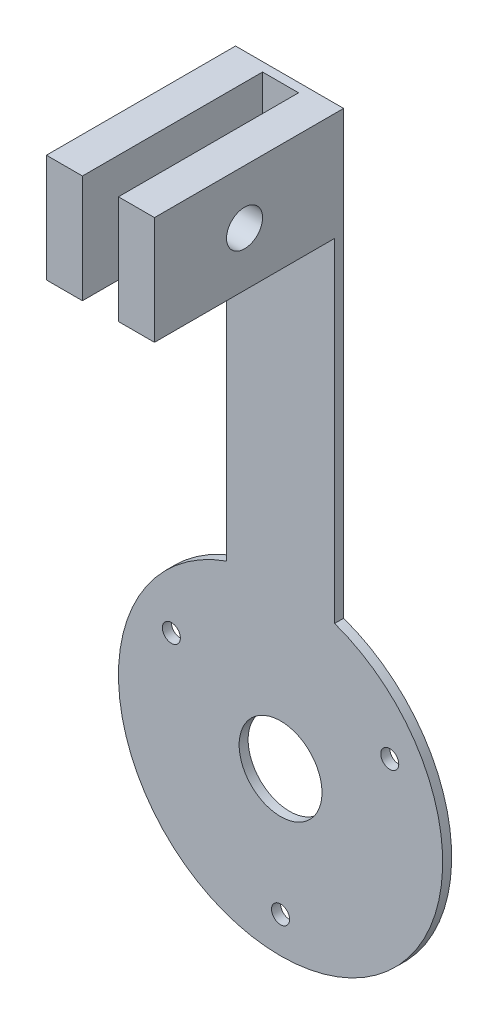
ISO-10303-21;
HEADER;
FILE_DESCRIPTION(('STEP AP214'),'2;1');
FILE_NAME('part.step','',(''),(''),'','','');
FILE_SCHEMA(('AUTOMOTIVE_DESIGN { 1 0 10303 214 1 1 1 1 }'));
ENDSEC;
DATA;
#1=APPLICATION_CONTEXT('core data for automotive mechanical design processes');
#2=APPLICATION_PROTOCOL_DEFINITION('international standard','automotive_design',2000,#1);
#3=PRODUCT_CONTEXT('',#1,'mechanical');
#4=PRODUCT('Part','Part','',(#3));
#5=PRODUCT_RELATED_PRODUCT_CATEGORY('part','',(#4));
#6=PRODUCT_DEFINITION_FORMATION('','',#4);
#7=PRODUCT_DEFINITION_CONTEXT('part definition',#1,'design');
#8=PRODUCT_DEFINITION('design','',#6,#7);
#9=PRODUCT_DEFINITION_SHAPE('','',#8);
#10=(LENGTH_UNIT() NAMED_UNIT(*) SI_UNIT(.MILLI.,.METRE.));
#11=(NAMED_UNIT(*) PLANE_ANGLE_UNIT() SI_UNIT($,.RADIAN.));
#12=(NAMED_UNIT(*) SI_UNIT($,.STERADIAN.) SOLID_ANGLE_UNIT());
#13=UNCERTAINTY_MEASURE_WITH_UNIT(LENGTH_MEASURE(1.E-05),#10,'distance_accuracy_value','');
#14=(GEOMETRIC_REPRESENTATION_CONTEXT(3) GLOBAL_UNCERTAINTY_ASSIGNED_CONTEXT((#13)) GLOBAL_UNIT_ASSIGNED_CONTEXT((#10,
#11,#12)) REPRESENTATION_CONTEXT('',''));
#15=CARTESIAN_POINT('',(0.,0.,0.));
#16=DIRECTION('',(0.,0.,1.));
#17=DIRECTION('',(1.,0.,0.));
#18=AXIS2_PLACEMENT_3D('',#15,#16,#17);
#19=CARTESIAN_POINT('',(0.,0.,3.175));
#20=DIRECTION('',(0.,0.,1.));
#21=DIRECTION('',(1.,0.,0.));
#22=AXIS2_PLACEMENT_3D('',#19,#20,#21);
#23=PLANE('',#22);
#24=CARTESIAN_POINT('',(0.,0.,3.175));
#25=DIRECTION('',(0.,0.,1.));
#26=DIRECTION('',(1.,0.,0.));
#27=AXIS2_PLACEMENT_3D('',#24,#25,#26);
#28=CIRCLE('',#27,57.15);
#29=CARTESIAN_POINT('',(-19.05,53.8815367264149,3.175));
#30=VERTEX_POINT('',#29);
#31=CARTESIAN_POINT('',(19.05,53.8815367264149,3.175));
#32=VERTEX_POINT('',#31);
#33=EDGE_CURVE('E139',#30,#32,#28,.T.);
#34=ORIENTED_EDGE('',*,*,#33,.T.);
#35=DIRECTION('',(0.,1.,0.));
#36=VECTOR('',#35,1.);
#37=CARTESIAN_POINT('',(19.05,0.,3.175));
#38=LINE('',#37,#36);
#39=CARTESIAN_POINT('',(19.05,171.45,3.175));
#40=VERTEX_POINT('',#39);
#41=EDGE_CURVE('E252',#32,#40,#38,.T.);
#42=ORIENTED_EDGE('',*,*,#41,.T.);
#43=DIRECTION('',(1.,0.,0.));
#44=VECTOR('',#43,1.);
#45=CARTESIAN_POINT('',(0.,171.45,3.175));
#46=LINE('',#45,#44);
#47=CARTESIAN_POINT('',(6.34999999999998,171.45,3.175));
#48=VERTEX_POINT('',#47);
#49=EDGE_CURVE('E171',#48,#40,#46,.T.);
#50=ORIENTED_EDGE('',*,*,#49,.F.);
#51=DIRECTION('',(0.,-1.,0.));
#52=VECTOR('',#51,1.);
#53=CARTESIAN_POINT('',(6.34999999999995,0.,3.175));
#54=LINE('',#53,#52);
#55=CARTESIAN_POINT('',(6.34999999999999,209.55,3.175));
#56=VERTEX_POINT('',#55);
#57=EDGE_CURVE('E165',#56,#48,#54,.T.);
#58=ORIENTED_EDGE('',*,*,#57,.F.);
#59=DIRECTION('',(1.,0.,0.));
#60=VECTOR('',#59,1.);
#61=CARTESIAN_POINT('',(0.,209.55,3.175));
#62=LINE('',#61,#60);
#63=CARTESIAN_POINT('',(-6.34999999999999,209.55,3.175));
#64=VERTEX_POINT('',#63);
#65=EDGE_CURVE('E58',#64,#56,#62,.T.);
#66=ORIENTED_EDGE('',*,*,#65,.F.);
#67=DIRECTION('',(0.,-1.,0.));
#68=VECTOR('',#67,1.);
#69=CARTESIAN_POINT('',(-6.34999999999995,0.,3.175));
#70=LINE('',#69,#68);
#71=CARTESIAN_POINT('',(-6.34999999999998,171.45,3.175));
#72=VERTEX_POINT('',#71);
#73=EDGE_CURVE('E196',#64,#72,#70,.T.);
#74=ORIENTED_EDGE('',*,*,#73,.T.);
#75=DIRECTION('',(1.,0.,0.));
#76=VECTOR('',#75,1.);
#77=CARTESIAN_POINT('',(0.,171.45,3.175));
#78=LINE('',#77,#76);
#79=CARTESIAN_POINT('',(-19.05,171.45,3.175));
#80=VERTEX_POINT('',#79);
#81=EDGE_CURVE('E64',#80,#72,#78,.T.);
#82=ORIENTED_EDGE('',*,*,#81,.F.);
#83=DIRECTION('',(0.,1.,0.));
#84=VECTOR('',#83,1.);
#85=CARTESIAN_POINT('',(-19.05,0.,3.175));
#86=LINE('',#85,#84);
#87=EDGE_CURVE('E249',#30,#80,#86,.T.);
#88=ORIENTED_EDGE('',*,*,#87,.F.);
#89=EDGE_LOOP('',(#34,#42,#50,#58,#66,#74,#82,#88));
#90=FACE_BOUND('',#89,.T.);
#91=CARTESIAN_POINT('',(-38.4948291982183,22.225,3.175));
#92=DIRECTION('',(0.,0.,1.));
#93=DIRECTION('',(1.,0.,0.));
#94=AXIS2_PLACEMENT_3D('',#91,#92,#93);
#95=CIRCLE('',#94,3.175);
#96=CARTESIAN_POINT('',(-35.3198291982183,22.225,3.175));
#97=VERTEX_POINT('',#96);
#98=EDGE_CURVE('E230',#97,#97,#95,.T.);
#99=ORIENTED_EDGE('',*,*,#98,.F.);
#100=EDGE_LOOP('',(#99));
#101=FACE_BOUND('',#100,.T.);
#102=CARTESIAN_POINT('',(38.4948291982183,22.225,3.175));
#103=DIRECTION('',(0.,0.,1.));
#104=DIRECTION('',(1.,0.,0.));
#105=AXIS2_PLACEMENT_3D('',#102,#103,#104);
#106=CIRCLE('',#105,3.175);
#107=CARTESIAN_POINT('',(41.6698291982183,22.225,3.175));
#108=VERTEX_POINT('',#107);
#109=EDGE_CURVE('E238',#108,#108,#106,.T.);
#110=ORIENTED_EDGE('',*,*,#109,.F.);
#111=EDGE_LOOP('',(#110));
#112=FACE_BOUND('',#111,.T.);
#113=CARTESIAN_POINT('',(0.,-44.45,3.175));
#114=DIRECTION('',(0.,0.,1.));
#115=DIRECTION('',(1.,0.,0.));
#116=AXIS2_PLACEMENT_3D('',#113,#114,#115);
#117=CIRCLE('',#116,3.175);
#118=CARTESIAN_POINT('',(3.175,-44.45,3.175));
#119=VERTEX_POINT('',#118);
#120=EDGE_CURVE('E226',#119,#119,#117,.T.);
#121=ORIENTED_EDGE('',*,*,#120,.F.);
#122=EDGE_LOOP('',(#121));
#123=FACE_BOUND('',#122,.T.);
#124=CARTESIAN_POINT('',(0.,0.,3.175));
#125=DIRECTION('',(0.,0.,1.));
#126=DIRECTION('',(1.,0.,0.));
#127=AXIS2_PLACEMENT_3D('',#124,#125,#126);
#128=CIRCLE('',#127,14.605);
#129=CARTESIAN_POINT('',(14.605,0.,3.175));
#130=VERTEX_POINT('',#129);
#131=EDGE_CURVE('E259',#130,#130,#128,.T.);
#132=ORIENTED_EDGE('',*,*,#131,.F.);
#133=EDGE_LOOP('',(#132));
#134=FACE_BOUND('',#133,.T.);
#135=ADVANCED_FACE('F41',(#90,#101,#112,#123,#134),#23,.T.);
#136=CARTESIAN_POINT('',(-19.05,0.,3.175));
#137=DIRECTION('',(-1.,0.,0.));
#138=DIRECTION('',(0.,0.,1.));
#139=AXIS2_PLACEMENT_3D('',#136,#137,#138);
#140=PLANE('',#139);
#141=CARTESIAN_POINT('',(-19.05,190.5,34.925));
#142=DIRECTION('',(-1.,0.,0.));
#143=DIRECTION('',(0.,0.,1.));
#144=AXIS2_PLACEMENT_3D('',#141,#142,#143);
#145=CIRCLE('',#144,6.35);
#146=CARTESIAN_POINT('',(-19.05,190.5,41.275));
#147=VERTEX_POINT('',#146);
#148=EDGE_CURVE('E152',#147,#147,#145,.T.);
#149=ORIENTED_EDGE('',*,*,#148,.F.);
#150=EDGE_LOOP('',(#149));
#151=FACE_BOUND('',#150,.T.);
#152=DIRECTION('',(0.,1.,0.));
#153=VECTOR('',#152,1.);
#154=CARTESIAN_POINT('',(-19.05,0.,0.));
#155=LINE('',#154,#153);
#156=CARTESIAN_POINT('',(-19.05,53.8815367264149,0.));
#157=VERTEX_POINT('',#156);
#158=CARTESIAN_POINT('',(-19.05,209.55,0.));
#159=VERTEX_POINT('',#158);
#160=EDGE_CURVE('E119',#157,#159,#155,.T.);
#161=ORIENTED_EDGE('',*,*,#160,.F.);
#162=DIRECTION('',(0.,0.,1.));
#163=VECTOR('',#162,1.);
#164=CARTESIAN_POINT('',(-19.05,53.8815367264149,0.));
#165=LINE('',#164,#163);
#166=EDGE_CURVE('E121',#157,#30,#165,.T.);
#167=ORIENTED_EDGE('',*,*,#166,.T.);
#168=ORIENTED_EDGE('',*,*,#87,.T.);
#169=DIRECTION('',(0.,0.,-1.));
#170=VECTOR('',#169,1.);
#171=CARTESIAN_POINT('',(-19.05,171.45,66.675));
#172=LINE('',#171,#170);
#173=CARTESIAN_POINT('',(-19.05,171.45,66.675));
#174=VERTEX_POINT('',#173);
#175=EDGE_CURVE('E219',#174,#80,#172,.T.);
#176=ORIENTED_EDGE('',*,*,#175,.F.);
#177=DIRECTION('',(0.,-1.,0.));
#178=VECTOR('',#177,1.);
#179=CARTESIAN_POINT('',(-19.05,0.,66.675));
#180=LINE('',#179,#178);
#181=CARTESIAN_POINT('',(-19.05,209.55,66.675));
#182=VERTEX_POINT('',#181);
#183=EDGE_CURVE('E205',#182,#174,#180,.T.);
#184=ORIENTED_EDGE('',*,*,#183,.F.);
#185=DIRECTION('',(0.,0.,-1.));
#186=VECTOR('',#185,1.);
#187=CARTESIAN_POINT('',(-19.05,209.55,3.175));
#188=LINE('',#187,#186);
#189=EDGE_CURVE('E51',#182,#159,#188,.T.);
#190=ORIENTED_EDGE('',*,*,#189,.T.);
#191=EDGE_LOOP('',(#161,#167,#168,#176,#184,#190));
#192=FACE_BOUND('',#191,.T.);
#193=ADVANCED_FACE('F43',(#151,#192),#140,.T.);
#194=CARTESIAN_POINT('',(19.05,0.,3.175));
#195=DIRECTION('',(-1.,0.,0.));
#196=DIRECTION('',(0.,0.,1.));
#197=AXIS2_PLACEMENT_3D('',#194,#195,#196);
#198=PLANE('',#197);
#199=CARTESIAN_POINT('',(19.05,190.5,34.925));
#200=DIRECTION('',(-1.,0.,0.));
#201=DIRECTION('',(0.,0.,1.));
#202=AXIS2_PLACEMENT_3D('',#199,#200,#201);
#203=CIRCLE('',#202,6.35);
#204=CARTESIAN_POINT('',(19.05,190.5,41.275));
#205=VERTEX_POINT('',#204);
#206=EDGE_CURVE('E161',#205,#205,#203,.T.);
#207=ORIENTED_EDGE('',*,*,#206,.T.);
#208=EDGE_LOOP('',(#207));
#209=FACE_BOUND('',#208,.T.);
#210=DIRECTION('',(0.,1.,0.));
#211=VECTOR('',#210,1.);
#212=CARTESIAN_POINT('',(19.05,0.,0.));
#213=LINE('',#212,#211);
#214=CARTESIAN_POINT('',(19.05,53.8815367264149,0.));
#215=VERTEX_POINT('',#214);
#216=CARTESIAN_POINT('',(19.05,209.55,0.));
#217=VERTEX_POINT('',#216);
#218=EDGE_CURVE('E129',#215,#217,#213,.T.);
#219=ORIENTED_EDGE('',*,*,#218,.T.);
#220=DIRECTION('',(0.,0.,-1.));
#221=VECTOR('',#220,1.);
#222=CARTESIAN_POINT('',(19.05,209.55,3.175));
#223=LINE('',#222,#221);
#224=CARTESIAN_POINT('',(19.05,209.55,66.675));
#225=VERTEX_POINT('',#224);
#226=EDGE_CURVE('E11',#225,#217,#223,.T.);
#227=ORIENTED_EDGE('',*,*,#226,.F.);
#228=DIRECTION('',(0.,1.,0.));
#229=VECTOR('',#228,1.);
#230=CARTESIAN_POINT('',(19.05,0.,66.675));
#231=LINE('',#230,#229);
#232=CARTESIAN_POINT('',(19.05,171.45,66.675));
#233=VERTEX_POINT('',#232);
#234=EDGE_CURVE('E174',#233,#225,#231,.T.);
#235=ORIENTED_EDGE('',*,*,#234,.F.);
#236=DIRECTION('',(0.,0.,-1.));
#237=VECTOR('',#236,1.);
#238=CARTESIAN_POINT('',(19.05,171.45,66.675));
#239=LINE('',#238,#237);
#240=EDGE_CURVE('E189',#233,#40,#239,.T.);
#241=ORIENTED_EDGE('',*,*,#240,.T.);
#242=ORIENTED_EDGE('',*,*,#41,.F.);
#243=DIRECTION('',(0.,0.,1.));
#244=VECTOR('',#243,1.);
#245=CARTESIAN_POINT('',(19.05,53.8815367264149,0.));
#246=LINE('',#245,#244);
#247=EDGE_CURVE('E141',#215,#32,#246,.T.);
#248=ORIENTED_EDGE('',*,*,#247,.F.);
#249=EDGE_LOOP('',(#219,#227,#235,#241,#242,#248));
#250=FACE_BOUND('',#249,.T.);
#251=ADVANCED_FACE('F287',(#209,#250),#198,.F.);
#252=CARTESIAN_POINT('',(0.,209.55,3.175));
#253=DIRECTION('',(0.,1.,0.));
#254=DIRECTION('',(0.,0.,1.));
#255=AXIS2_PLACEMENT_3D('',#252,#253,#254);
#256=PLANE('',#255);
#257=DIRECTION('',(1.,0.,0.));
#258=VECTOR('',#257,1.);
#259=CARTESIAN_POINT('',(0.,209.55,0.));
#260=LINE('',#259,#258);
#261=EDGE_CURVE('E265',#159,#217,#260,.T.);
#262=ORIENTED_EDGE('',*,*,#261,.F.);
#263=ORIENTED_EDGE('',*,*,#189,.F.);
#264=DIRECTION('',(-1.,0.,0.));
#265=VECTOR('',#264,1.);
#266=CARTESIAN_POINT('',(0.,209.55,66.675));
#267=LINE('',#266,#265);
#268=CARTESIAN_POINT('',(-6.34999999999999,209.55,66.675));
#269=VERTEX_POINT('',#268);
#270=EDGE_CURVE('E201',#269,#182,#267,.T.);
#271=ORIENTED_EDGE('',*,*,#270,.F.);
#272=DIRECTION('',(0.,0.,-1.));
#273=VECTOR('',#272,1.);
#274=CARTESIAN_POINT('',(-6.34999999999999,209.55,66.675));
#275=LINE('',#274,#273);
#276=EDGE_CURVE('E223',#269,#64,#275,.T.);
#277=ORIENTED_EDGE('',*,*,#276,.T.);
#278=ORIENTED_EDGE('',*,*,#65,.T.);
#279=DIRECTION('',(0.,0.,-1.));
#280=VECTOR('',#279,1.);
#281=CARTESIAN_POINT('',(6.34999999999999,209.55,66.675));
#282=LINE('',#281,#280);
#283=CARTESIAN_POINT('',(6.34999999999999,209.55,66.675));
#284=VERTEX_POINT('',#283);
#285=EDGE_CURVE('E181',#284,#56,#282,.T.);
#286=ORIENTED_EDGE('',*,*,#285,.F.);
#287=DIRECTION('',(-1.,0.,0.));
#288=VECTOR('',#287,1.);
#289=CARTESIAN_POINT('',(0.,209.55,66.675));
#290=LINE('',#289,#288);
#291=EDGE_CURVE('E178',#225,#284,#290,.T.);
#292=ORIENTED_EDGE('',*,*,#291,.F.);
#293=ORIENTED_EDGE('',*,*,#226,.T.);
#294=EDGE_LOOP('',(#262,#263,#271,#277,#278,#286,#292,#293));
#295=FACE_BOUND('',#294,.T.);
#296=ADVANCED_FACE('F290',(#295),#256,.T.);
#297=CARTESIAN_POINT('',(0.,0.,3.175));
#298=DIRECTION('',(0.,0.,-1.));
#299=DIRECTION('',(-1.,0.,0.));
#300=AXIS2_PLACEMENT_3D('',#297,#298,#299);
#301=CYLINDRICAL_SURFACE('',#300,14.605);
#302=ORIENTED_EDGE('',*,*,#131,.T.);
#303=EDGE_LOOP('',(#302));
#304=FACE_BOUND('',#303,.T.);
#305=CARTESIAN_POINT('',(0.,0.,0.));
#306=DIRECTION('',(0.,0.,1.));
#307=DIRECTION('',(1.,0.,0.));
#308=AXIS2_PLACEMENT_3D('',#305,#306,#307);
#309=CIRCLE('',#308,14.605);
#310=CARTESIAN_POINT('',(14.605,0.,0.));
#311=VERTEX_POINT('',#310);
#312=EDGE_CURVE('E253',#311,#311,#309,.T.);
#313=ORIENTED_EDGE('',*,*,#312,.F.);
#314=EDGE_LOOP('',(#313));
#315=FACE_BOUND('',#314,.T.);
#316=ADVANCED_FACE('F339',(#304,#315),#301,.F.);
#317=CARTESIAN_POINT('',(0.,0.,0.));
#318=DIRECTION('',(0.,0.,1.));
#319=DIRECTION('',(1.,0.,0.));
#320=AXIS2_PLACEMENT_3D('',#317,#318,#319);
#321=PLANE('',#320);
#322=CARTESIAN_POINT('',(-38.4948291982183,22.225,0.));
#323=DIRECTION('',(0.,0.,1.));
#324=DIRECTION('',(1.,0.,0.));
#325=AXIS2_PLACEMENT_3D('',#322,#323,#324);
#326=CIRCLE('',#325,3.175);
#327=CARTESIAN_POINT('',(-35.3198291982183,22.225,0.));
#328=VERTEX_POINT('',#327);
#329=EDGE_CURVE('E130',#328,#328,#326,.T.);
#330=ORIENTED_EDGE('',*,*,#329,.T.);
#331=EDGE_LOOP('',(#330));
#332=FACE_BOUND('',#331,.T.);
#333=CARTESIAN_POINT('',(38.4948291982183,22.225,0.));
#334=DIRECTION('',(0.,0.,1.));
#335=DIRECTION('',(1.,0.,0.));
#336=AXIS2_PLACEMENT_3D('',#333,#334,#335);
#337=CIRCLE('',#336,3.175);
#338=CARTESIAN_POINT('',(41.6698291982183,22.225,0.));
#339=VERTEX_POINT('',#338);
#340=EDGE_CURVE('E234',#339,#339,#337,.T.);
#341=ORIENTED_EDGE('',*,*,#340,.T.);
#342=EDGE_LOOP('',(#341));
#343=FACE_BOUND('',#342,.T.);
#344=CARTESIAN_POINT('',(0.,-44.45,0.));
#345=DIRECTION('',(0.,0.,1.));
#346=DIRECTION('',(1.,0.,0.));
#347=AXIS2_PLACEMENT_3D('',#344,#345,#346);
#348=CIRCLE('',#347,3.175);
#349=CARTESIAN_POINT('',(3.175,-44.45,0.));
#350=VERTEX_POINT('',#349);
#351=EDGE_CURVE('E242',#350,#350,#348,.T.);
#352=ORIENTED_EDGE('',*,*,#351,.T.);
#353=EDGE_LOOP('',(#352));
#354=FACE_BOUND('',#353,.T.);
#355=ORIENTED_EDGE('',*,*,#218,.F.);
#356=CARTESIAN_POINT('',(0.,0.,0.));
#357=DIRECTION('',(0.,0.,1.));
#358=DIRECTION('',(1.,0.,0.));
#359=AXIS2_PLACEMENT_3D('',#356,#357,#358);
#360=CIRCLE('',#359,57.15);
#361=EDGE_CURVE('E136',#157,#215,#360,.T.);
#362=ORIENTED_EDGE('',*,*,#361,.F.);
#363=ORIENTED_EDGE('',*,*,#160,.T.);
#364=ORIENTED_EDGE('',*,*,#261,.T.);
#365=EDGE_LOOP('',(#355,#362,#363,#364));
#366=FACE_BOUND('',#365,.T.);
#367=ORIENTED_EDGE('',*,*,#312,.T.);
#368=EDGE_LOOP('',(#367));
#369=FACE_BOUND('',#368,.T.);
#370=ADVANCED_FACE('F143',(#332,#343,#354,#366,#369),#321,.F.);
#371=CARTESIAN_POINT('',(0.,-44.45,0.));
#372=DIRECTION('',(0.,0.,1.));
#373=DIRECTION('',(1.,0.,0.));
#374=AXIS2_PLACEMENT_3D('',#371,#372,#373);
#375=CYLINDRICAL_SURFACE('',#374,3.175);
#376=ORIENTED_EDGE('',*,*,#351,.F.);
#377=EDGE_LOOP('',(#376));
#378=FACE_BOUND('',#377,.T.);
#379=ORIENTED_EDGE('',*,*,#120,.T.);
#380=EDGE_LOOP('',(#379));
#381=FACE_BOUND('',#380,.T.);
#382=ADVANCED_FACE('F335',(#378,#381),#375,.F.);
#383=CARTESIAN_POINT('',(38.4948291982183,22.225,0.));
#384=DIRECTION('',(0.,0.,1.));
#385=DIRECTION('',(1.,0.,0.));
#386=AXIS2_PLACEMENT_3D('',#383,#384,#385);
#387=CYLINDRICAL_SURFACE('',#386,3.175);
#388=ORIENTED_EDGE('',*,*,#340,.F.);
#389=EDGE_LOOP('',(#388));
#390=FACE_BOUND('',#389,.T.);
#391=ORIENTED_EDGE('',*,*,#109,.T.);
#392=EDGE_LOOP('',(#391));
#393=FACE_BOUND('',#392,.T.);
#394=ADVANCED_FACE('F323',(#390,#393),#387,.F.);
#395=CARTESIAN_POINT('',(-38.4948291982183,22.225,0.));
#396=DIRECTION('',(0.,0.,1.));
#397=DIRECTION('',(1.,0.,0.));
#398=AXIS2_PLACEMENT_3D('',#395,#396,#397);
#399=CYLINDRICAL_SURFACE('',#398,3.175);
#400=ORIENTED_EDGE('',*,*,#329,.F.);
#401=EDGE_LOOP('',(#400));
#402=FACE_BOUND('',#401,.T.);
#403=ORIENTED_EDGE('',*,*,#98,.T.);
#404=EDGE_LOOP('',(#403));
#405=FACE_BOUND('',#404,.T.);
#406=ADVANCED_FACE('F315',(#402,#405),#399,.F.);
#407=CARTESIAN_POINT('',(-6.34999999999995,0.,66.675));
#408=DIRECTION('',(1.,0.,0.));
#409=DIRECTION('',(0.,1.,0.));
#410=AXIS2_PLACEMENT_3D('',#407,#408,#409);
#411=PLANE('',#410);
#412=CARTESIAN_POINT('',(-6.34999999999998,190.5,34.925));
#413=DIRECTION('',(1.,0.,0.));
#414=DIRECTION('',(0.,1.,0.));
#415=AXIS2_PLACEMENT_3D('',#412,#413,#414);
#416=CIRCLE('',#415,6.35);
#417=CARTESIAN_POINT('',(-6.34999999999998,196.85,34.925));
#418=VERTEX_POINT('',#417);
#419=EDGE_CURVE('E157',#418,#418,#416,.T.);
#420=ORIENTED_EDGE('',*,*,#419,.F.);
#421=EDGE_LOOP('',(#420));
#422=FACE_BOUND('',#421,.T.);
#423=ORIENTED_EDGE('',*,*,#73,.F.);
#424=ORIENTED_EDGE('',*,*,#276,.F.);
#425=DIRECTION('',(0.,-1.,0.));
#426=VECTOR('',#425,1.);
#427=CARTESIAN_POINT('',(-6.34999999999995,0.,66.675));
#428=LINE('',#427,#426);
#429=CARTESIAN_POINT('',(-6.34999999999998,171.45,66.675));
#430=VERTEX_POINT('',#429);
#431=EDGE_CURVE('E197',#269,#430,#428,.T.);
#432=ORIENTED_EDGE('',*,*,#431,.T.);
#433=DIRECTION('',(0.,0.,-1.));
#434=VECTOR('',#433,1.);
#435=CARTESIAN_POINT('',(-6.34999999999998,171.45,66.675));
#436=LINE('',#435,#434);
#437=EDGE_CURVE('E211',#430,#72,#436,.T.);
#438=ORIENTED_EDGE('',*,*,#437,.T.);
#439=EDGE_LOOP('',(#423,#424,#432,#438));
#440=FACE_BOUND('',#439,.T.);
#441=ADVANCED_FACE('F313',(#422,#440),#411,.T.);
#442=CARTESIAN_POINT('',(0.,171.45,66.675));
#443=DIRECTION('',(0.,1.,0.));
#444=DIRECTION('',(0.,0.,1.));
#445=AXIS2_PLACEMENT_3D('',#442,#443,#444);
#446=PLANE('',#445);
#447=ORIENTED_EDGE('',*,*,#81,.T.);
#448=ORIENTED_EDGE('',*,*,#437,.F.);
#449=DIRECTION('',(1.,0.,0.));
#450=VECTOR('',#449,1.);
#451=CARTESIAN_POINT('',(0.,171.45,66.675));
#452=LINE('',#451,#450);
#453=EDGE_CURVE('E208',#174,#430,#452,.T.);
#454=ORIENTED_EDGE('',*,*,#453,.F.);
#455=ORIENTED_EDGE('',*,*,#175,.T.);
#456=EDGE_LOOP('',(#447,#448,#454,#455));
#457=FACE_BOUND('',#456,.T.);
#458=ADVANCED_FACE('F306',(#457),#446,.F.);
#459=CARTESIAN_POINT('',(0.,0.,66.675));
#460=DIRECTION('',(0.,0.,1.));
#461=DIRECTION('',(1.,0.,0.));
#462=AXIS2_PLACEMENT_3D('',#459,#460,#461);
#463=PLANE('',#462);
#464=ORIENTED_EDGE('',*,*,#431,.F.);
#465=ORIENTED_EDGE('',*,*,#270,.T.);
#466=ORIENTED_EDGE('',*,*,#183,.T.);
#467=ORIENTED_EDGE('',*,*,#453,.T.);
#468=EDGE_LOOP('',(#464,#465,#466,#467));
#469=FACE_BOUND('',#468,.T.);
#470=ADVANCED_FACE('F310',(#469),#463,.T.);
#471=CARTESIAN_POINT('',(6.34999999999995,0.,66.675));
#472=DIRECTION('',(1.,0.,0.));
#473=DIRECTION('',(0.,1.,0.));
#474=AXIS2_PLACEMENT_3D('',#471,#472,#473);
#475=PLANE('',#474);
#476=CARTESIAN_POINT('',(6.34999999999998,190.5,34.925));
#477=DIRECTION('',(1.,0.,0.));
#478=DIRECTION('',(0.,1.,0.));
#479=AXIS2_PLACEMENT_3D('',#476,#477,#478);
#480=CIRCLE('',#479,6.35);
#481=CARTESIAN_POINT('',(6.34999999999998,196.85,34.925));
#482=VERTEX_POINT('',#481);
#483=EDGE_CURVE('E45',#482,#482,#480,.T.);
#484=ORIENTED_EDGE('',*,*,#483,.T.);
#485=EDGE_LOOP('',(#484));
#486=FACE_BOUND('',#485,.T.);
#487=ORIENTED_EDGE('',*,*,#57,.T.);
#488=DIRECTION('',(0.,0.,-1.));
#489=VECTOR('',#488,1.);
#490=CARTESIAN_POINT('',(6.34999999999998,171.45,66.675));
#491=LINE('',#490,#489);
#492=CARTESIAN_POINT('',(6.34999999999998,171.45,66.675));
#493=VERTEX_POINT('',#492);
#494=EDGE_CURVE('E193',#493,#48,#491,.T.);
#495=ORIENTED_EDGE('',*,*,#494,.F.);
#496=DIRECTION('',(0.,-1.,0.));
#497=VECTOR('',#496,1.);
#498=CARTESIAN_POINT('',(6.34999999999995,0.,66.675));
#499=LINE('',#498,#497);
#500=EDGE_CURVE('E166',#284,#493,#499,.T.);
#501=ORIENTED_EDGE('',*,*,#500,.F.);
#502=ORIENTED_EDGE('',*,*,#285,.T.);
#503=EDGE_LOOP('',(#487,#495,#501,#502));
#504=FACE_BOUND('',#503,.T.);
#505=ADVANCED_FACE('F276',(#486,#504),#475,.F.);
#506=CARTESIAN_POINT('',(0.,171.45,66.675));
#507=DIRECTION('',(0.,1.,0.));
#508=DIRECTION('',(0.,0.,1.));
#509=AXIS2_PLACEMENT_3D('',#506,#507,#508);
#510=PLANE('',#509);
#511=ORIENTED_EDGE('',*,*,#49,.T.);
#512=ORIENTED_EDGE('',*,*,#240,.F.);
#513=DIRECTION('',(1.,0.,0.));
#514=VECTOR('',#513,1.);
#515=CARTESIAN_POINT('',(0.,171.45,66.675));
#516=LINE('',#515,#514);
#517=EDGE_CURVE('E170',#493,#233,#516,.T.);
#518=ORIENTED_EDGE('',*,*,#517,.F.);
#519=ORIENTED_EDGE('',*,*,#494,.T.);
#520=EDGE_LOOP('',(#511,#512,#518,#519));
#521=FACE_BOUND('',#520,.T.);
#522=ADVANCED_FACE('F453',(#521),#510,.F.);
#523=CARTESIAN_POINT('',(0.,0.,66.675));
#524=DIRECTION('',(0.,0.,1.));
#525=DIRECTION('',(1.,0.,0.));
#526=AXIS2_PLACEMENT_3D('',#523,#524,#525);
#527=PLANE('',#526);
#528=ORIENTED_EDGE('',*,*,#500,.T.);
#529=ORIENTED_EDGE('',*,*,#517,.T.);
#530=ORIENTED_EDGE('',*,*,#234,.T.);
#531=ORIENTED_EDGE('',*,*,#291,.T.);
#532=EDGE_LOOP('',(#528,#529,#530,#531));
#533=FACE_BOUND('',#532,.T.);
#534=ADVANCED_FACE('F283',(#533),#527,.T.);
#535=CARTESIAN_POINT('',(88.9,190.5,34.925));
#536=DIRECTION('',(-1.,0.,0.));
#537=DIRECTION('',(0.,0.,1.));
#538=AXIS2_PLACEMENT_3D('',#535,#536,#537);
#539=CYLINDRICAL_SURFACE('',#538,6.35);
#540=ORIENTED_EDGE('',*,*,#483,.F.);
#541=EDGE_LOOP('',(#540));
#542=FACE_BOUND('',#541,.T.);
#543=ORIENTED_EDGE('',*,*,#206,.F.);
#544=EDGE_LOOP('',(#543));
#545=FACE_BOUND('',#544,.T.);
#546=ADVANCED_FACE('F279',(#542,#545),#539,.F.);
#547=ORIENTED_EDGE('',*,*,#419,.T.);
#548=EDGE_LOOP('',(#547));
#549=FACE_BOUND('',#548,.T.);
#550=ORIENTED_EDGE('',*,*,#148,.T.);
#551=EDGE_LOOP('',(#550));
#552=FACE_BOUND('',#551,.T.);
#553=ADVANCED_FACE('F282',(#549,#552),#539,.F.);
#554=CARTESIAN_POINT('',(0.,0.,0.));
#555=DIRECTION('',(0.,0.,1.));
#556=DIRECTION('',(1.,0.,0.));
#557=AXIS2_PLACEMENT_3D('',#554,#555,#556);
#558=CYLINDRICAL_SURFACE('',#557,57.15);
#559=ORIENTED_EDGE('',*,*,#33,.F.);
#560=ORIENTED_EDGE('',*,*,#166,.F.);
#561=ORIENTED_EDGE('',*,*,#361,.T.);
#562=ORIENTED_EDGE('',*,*,#247,.T.);
#563=EDGE_LOOP('',(#559,#560,#561,#562));
#564=FACE_BOUND('',#563,.T.);
#565=ADVANCED_FACE('F134',(#564),#558,.T.);
#566=CLOSED_SHELL('',(#135,#193,#251,#296,#316,#370,#382,#394,#406,#441,#458,#470,#505,#522,
#534,#546,#553,#565));
#567=MANIFOLD_SOLID_BREP('B2',#566);
#568=ADVANCED_BREP_SHAPE_REPRESENTATION('',(#18,#567),#14);
#569=SHAPE_DEFINITION_REPRESENTATION(#9,#568);
ENDSEC;
END-ISO-10303-21;
